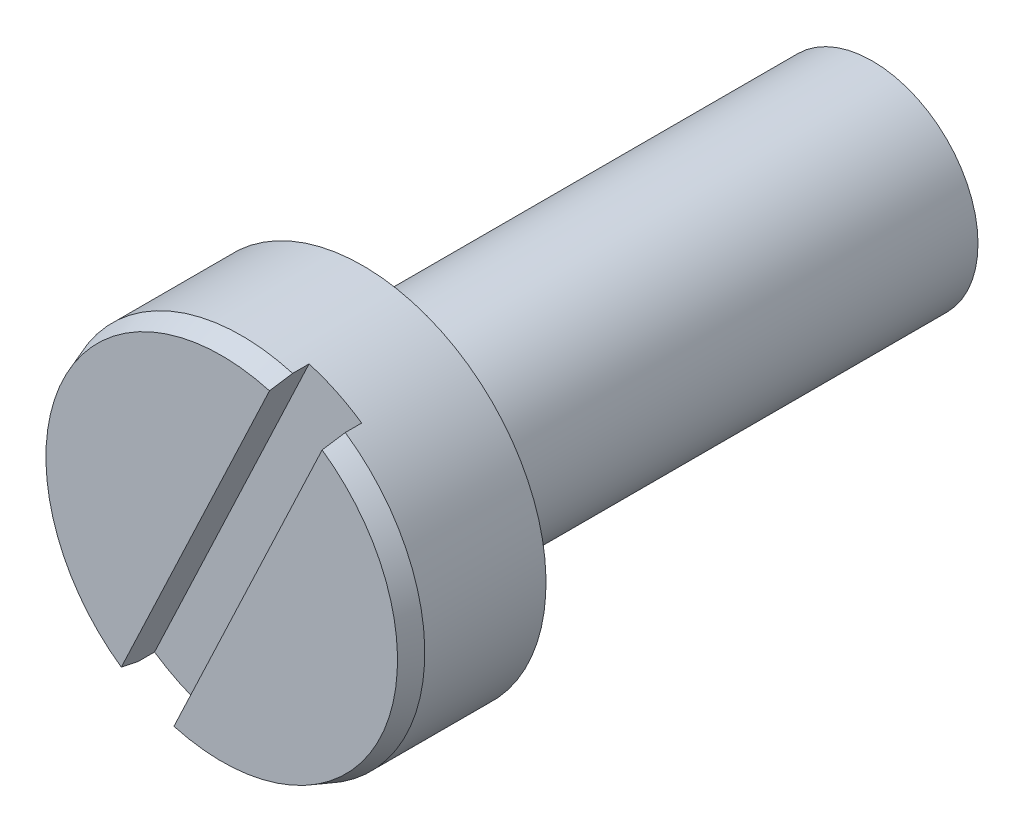
ISO-10303-21;
HEADER;
FILE_DESCRIPTION(('STEP AP214'),'2;1');
FILE_NAME('part.step','',(''),(''),'','','');
FILE_SCHEMA(('AUTOMOTIVE_DESIGN { 1 0 10303 214 1 1 1 1 }'));
ENDSEC;
DATA;
#1=APPLICATION_CONTEXT('core data for automotive mechanical design processes');
#2=APPLICATION_PROTOCOL_DEFINITION('international standard','automotive_design',2000,#1);
#3=PRODUCT_CONTEXT('',#1,'mechanical');
#4=PRODUCT('Part','Part','',(#3));
#5=PRODUCT_RELATED_PRODUCT_CATEGORY('part','',(#4));
#6=PRODUCT_DEFINITION_FORMATION('','',#4);
#7=PRODUCT_DEFINITION_CONTEXT('part definition',#1,'design');
#8=PRODUCT_DEFINITION('design','',#6,#7);
#9=PRODUCT_DEFINITION_SHAPE('','',#8);
#10=(LENGTH_UNIT() NAMED_UNIT(*) SI_UNIT(.MILLI.,.METRE.));
#11=(NAMED_UNIT(*) PLANE_ANGLE_UNIT() SI_UNIT($,.RADIAN.));
#12=(NAMED_UNIT(*) SI_UNIT($,.STERADIAN.) SOLID_ANGLE_UNIT());
#13=UNCERTAINTY_MEASURE_WITH_UNIT(LENGTH_MEASURE(1.E-05),#10,'distance_accuracy_value','');
#14=(GEOMETRIC_REPRESENTATION_CONTEXT(3) GLOBAL_UNCERTAINTY_ASSIGNED_CONTEXT((#13)) GLOBAL_UNIT_ASSIGNED_CONTEXT((#10,
#11,#12)) REPRESENTATION_CONTEXT('',''));
#15=CARTESIAN_POINT('',(0.,0.,0.));
#16=DIRECTION('',(0.,0.,1.));
#17=DIRECTION('',(1.,0.,0.));
#18=AXIS2_PLACEMENT_3D('',#15,#16,#17);
#19=CARTESIAN_POINT('',(22.8721980967912,-23.3190432182495,19.8000000000006));
#20=DIRECTION('',(0.,0.,-1.));
#21=DIRECTION('',(0.427457329703379,0.904035525453982,0.));
#22=AXIS2_PLACEMENT_3D('',#19,#20,#21);
#23=TOROIDAL_SURFACE('',#22,1.95,0.5);
#24=CARTESIAN_POINT('',(22.8721980967912,-23.3190432182495,19.8000000000006));
#25=DIRECTION('',(0.,0.,-1.));
#26=DIRECTION('',(0.427457329703379,0.904035525453982,0.));
#27=AXIS2_PLACEMENT_3D('',#24,#25,#26);
#28=CIRCLE('',#27,1.45);
#29=CARTESIAN_POINT('',(23.4920112248611,-22.0081917063412,19.8000000000006));
#30=VERTEX_POINT('',#29);
#31=EDGE_CURVE('E11',#30,#30,#28,.T.);
#32=ORIENTED_EDGE('',*,*,#31,.F.);
#33=EDGE_LOOP('',(#32));
#34=FACE_BOUND('',#33,.T.);
#35=CARTESIAN_POINT('',(22.8721980967912,-23.3190432182488,20.3000000000006));
#36=DIRECTION('',(0.,0.,1.));
#37=DIRECTION('',(0.427457329703379,0.904035525453982,0.));
#38=AXIS2_PLACEMENT_3D('',#35,#36,#37);
#39=CIRCLE('',#38,1.95);
#40=CARTESIAN_POINT('',(23.7057398897128,-21.5561739436135,20.3000000000006));
#41=VERTEX_POINT('',#40);
#42=EDGE_CURVE('E125',#41,#41,#39,.T.);
#43=ORIENTED_EDGE('',*,*,#42,.F.);
#44=EDGE_LOOP('',(#43));
#45=FACE_BOUND('',#44,.T.);
#46=ADVANCED_FACE('F17',(#34,#45),#23,.F.);
#47=CARTESIAN_POINT('',(22.8721980967912,-23.3190432182486,13.3000000000006));
#48=DIRECTION('',(0.,0.,1.));
#49=DIRECTION('',(-0.427457329703379,-0.904035525453982,0.));
#50=AXIS2_PLACEMENT_3D('',#47,#48,#49);
#51=CONICAL_SURFACE('',#50,1.175252258055,1.221730476396);
#52=CARTESIAN_POINT('',(22.8721980967912,-23.3190432182486,13.3000000000006));
#53=DIRECTION('',(0.,0.,-1.));
#54=DIRECTION('',(0.427457329703379,0.904035525453982,0.));
#55=AXIS2_PLACEMENT_3D('',#52,#53,#54);
#56=CIRCLE('',#55,1.175252258055);
#57=CARTESIAN_POINT('',(23.3745682887473,-22.2565734255969,13.3000000000006));
#58=VERTEX_POINT('',#57);
#59=EDGE_CURVE('E110',#58,#58,#56,.T.);
#60=ORIENTED_EDGE('',*,*,#59,.F.);
#61=EDGE_LOOP('',(#60));
#62=FACE_BOUND('',#61,.T.);
#63=CARTESIAN_POINT('',(22.8721980967912,-23.3190432182495,13.4000000000006));
#64=DIRECTION('',(0.,0.,1.));
#65=DIRECTION('',(0.427457329703379,0.904035525453982,0.));
#66=AXIS2_PLACEMENT_3D('',#63,#64,#65);
#67=CIRCLE('',#66,1.45);
#68=CARTESIAN_POINT('',(23.4920112248611,-22.0081917063412,13.4000000000006));
#69=VERTEX_POINT('',#68);
#70=EDGE_CURVE('E26',#69,#69,#67,.T.);
#71=ORIENTED_EDGE('',*,*,#70,.F.);
#72=EDGE_LOOP('',(#71));
#73=FACE_BOUND('',#72,.T.);
#74=ADVANCED_FACE('F181',(#62,#73),#51,.T.);
#75=CARTESIAN_POINT('',(22.8721980967912,-23.3190432182488,20.3000000000006));
#76=DIRECTION('',(0.,0.,1.));
#77=DIRECTION('',(-0.427457329703379,-0.904035525453982,0.));
#78=AXIS2_PLACEMENT_3D('',#75,#76,#77);
#79=CONICAL_SURFACE('',#78,2.240252258055,1.221730476396);
#80=CARTESIAN_POINT('',(22.8721980967912,-23.3190432182488,20.3000000000006));
#81=DIRECTION('',(0.,0.,-1.));
#82=DIRECTION('',(0.427457329703379,0.904035525453982,0.));
#83=AXIS2_PLACEMENT_3D('',#80,#81,#82);
#84=CIRCLE('',#83,2.240252258055);
#85=CARTESIAN_POINT('',(23.8298103448814,-21.2937755909886,20.3000000000006));
#86=VERTEX_POINT('',#85);
#87=EDGE_CURVE('E121',#86,#86,#84,.T.);
#88=ORIENTED_EDGE('',*,*,#87,.F.);
#89=EDGE_LOOP('',(#88));
#90=FACE_BOUND('',#89,.T.);
#91=CARTESIAN_POINT('',(22.8721980967912,-23.3190432182486,20.4000000000006));
#92=DIRECTION('',(0.,0.,1.));
#93=DIRECTION('',(0.427457329703379,0.904035525453982,0.));
#94=AXIS2_PLACEMENT_3D('',#91,#92,#93);
#95=CIRCLE('',#94,2.515);
#96=CARTESIAN_POINT('',(23.9472532809952,-21.0453938717319,20.4000000000006));
#97=VERTEX_POINT('',#96);
#98=EDGE_CURVE('E68',#97,#97,#95,.T.);
#99=ORIENTED_EDGE('',*,*,#98,.F.);
#100=EDGE_LOOP('',(#99));
#101=FACE_BOUND('',#100,.T.);
#102=ADVANCED_FACE('F186',(#90,#101),#79,.T.);
#103=CARTESIAN_POINT('',(22.8721980967912,-23.3190432182486,13.3000000000006));
#104=DIRECTION('',(0.,0.,-1.));
#105=DIRECTION('',(0.427457329703379,0.904035525453982,0.));
#106=AXIS2_PLACEMENT_3D('',#103,#104,#105);
#107=CYLINDRICAL_SURFACE('',#106,1.45);
#108=ORIENTED_EDGE('',*,*,#31,.T.);
#109=EDGE_LOOP('',(#108));
#110=FACE_BOUND('',#109,.T.);
#111=ORIENTED_EDGE('',*,*,#70,.T.);
#112=EDGE_LOOP('',(#111));
#113=FACE_BOUND('',#112,.T.);
#114=ADVANCED_FACE('F174',(#110,#113),#107,.T.);
#115=CARTESIAN_POINT('',(22.8721980967912,-23.3190432182486,13.3000000000006));
#116=DIRECTION('',(0.,0.,-1.));
#117=DIRECTION('',(0.427457329703379,0.904035525453982,0.));
#118=AXIS2_PLACEMENT_3D('',#115,#116,#117);
#119=CYLINDRICAL_SURFACE('',#118,2.515);
#120=CARTESIAN_POINT('',(22.8721980967912,-23.3190432182492,21.8400000000006));
#121=DIRECTION('',(0.,0.,-1.));
#122=DIRECTION('',(-0.427457329703369,-0.904035525453986,0.));
#123=AXIS2_PLACEMENT_3D('',#120,#121,#122);
#124=CIRCLE('',#123,2.515);
#125=CARTESIAN_POINT('',(22.1724412662472,-25.7347347089221,21.8400000000007));
#126=VERTEX_POINT('',#125);
#127=CARTESIAN_POINT('',(21.4492128458852,-25.3927688451593,21.8400000000006));
#128=VERTEX_POINT('',#127);
#129=EDGE_CURVE('E145',#126,#128,#124,.T.);
#130=ORIENTED_EDGE('',*,*,#129,.T.);
#131=DIRECTION('',(0.,0.,-1.));
#132=VECTOR('',#131,1.);
#133=CARTESIAN_POINT('',(21.4492128458852,-25.3927688451593,13.3000000000006));
#134=LINE('',#133,#132);
#135=CARTESIAN_POINT('',(21.4492128458852,-25.3927688451593,22.0652522580557));
#136=VERTEX_POINT('',#135);
#137=EDGE_CURVE('E64',#136,#128,#134,.T.);
#138=ORIENTED_EDGE('',*,*,#137,.F.);
#139=CARTESIAN_POINT('',(22.8721980967912,-23.3190432182491,22.0652522580556));
#140=DIRECTION('',(0.,0.,-1.));
#141=DIRECTION('',(-0.427457329703379,-0.904035525453982,0.));
#142=AXIS2_PLACEMENT_3D('',#139,#140,#141);
#143=CIRCLE('',#142,2.515);
#144=CARTESIAN_POINT('',(23.5719549273342,-20.9033517275762,22.0652522580557));
#145=VERTEX_POINT('',#144);
#146=EDGE_CURVE('E53',#136,#145,#143,.T.);
#147=ORIENTED_EDGE('',*,*,#146,.T.);
#148=DIRECTION('',(0.,0.,1.));
#149=VECTOR('',#148,1.);
#150=CARTESIAN_POINT('',(23.5719549273352,-20.9033517275767,13.3000000000006));
#151=LINE('',#150,#149);
#152=CARTESIAN_POINT('',(23.5719549273342,-20.9033517275763,21.8400000000006));
#153=VERTEX_POINT('',#152);
#154=EDGE_CURVE('E61',#153,#145,#151,.T.);
#155=ORIENTED_EDGE('',*,*,#154,.F.);
#156=CARTESIAN_POINT('',(22.8721980967912,-23.3190432182492,21.8400000000006));
#157=DIRECTION('',(0.,0.,-1.));
#158=DIRECTION('',(-0.427457329703379,-0.904035525453982,0.));
#159=AXIS2_PLACEMENT_3D('',#156,#157,#158);
#160=CIRCLE('',#159,2.515);
#161=CARTESIAN_POINT('',(24.2951833476972,-21.2453175913393,21.8400000000006));
#162=VERTEX_POINT('',#161);
#163=EDGE_CURVE('E93',#153,#162,#160,.T.);
#164=ORIENTED_EDGE('',*,*,#163,.T.);
#165=DIRECTION('',(0.,0.,-1.));
#166=VECTOR('',#165,1.);
#167=CARTESIAN_POINT('',(24.2951833476972,-21.2453175913386,13.3000000000006));
#168=LINE('',#167,#166);
#169=CARTESIAN_POINT('',(24.2951833476972,-21.2453175913392,22.0652522580557));
#170=VERTEX_POINT('',#169);
#171=EDGE_CURVE('E96',#170,#162,#168,.T.);
#172=ORIENTED_EDGE('',*,*,#171,.F.);
#173=CARTESIAN_POINT('',(22.1724412662472,-25.7347347089221,22.0652522580557));
#174=VERTEX_POINT('',#173);
#175=EDGE_CURVE('E106',#170,#174,#143,.T.);
#176=ORIENTED_EDGE('',*,*,#175,.T.);
#177=DIRECTION('',(0.,0.,1.));
#178=VECTOR('',#177,1.);
#179=CARTESIAN_POINT('',(22.1724412662472,-25.7347347089221,13.3000000000006));
#180=LINE('',#179,#178);
#181=EDGE_CURVE('E103',#126,#174,#180,.T.);
#182=ORIENTED_EDGE('',*,*,#181,.F.);
#183=EDGE_LOOP('',(#130,#138,#147,#155,#164,#172,#176,#182));
#184=FACE_BOUND('',#183,.T.);
#185=ORIENTED_EDGE('',*,*,#98,.T.);
#186=EDGE_LOOP('',(#185));
#187=FACE_BOUND('',#186,.T.);
#188=ADVANCED_FACE('F56',(#184,#187),#119,.T.);
#189=CARTESIAN_POINT('',(22.8721980967912,-23.3190432182496,22.3400000000006));
#190=DIRECTION('',(0.,0.,1.));
#191=DIRECTION('',(-0.427457329703379,-0.904035525453982,0.));
#192=AXIS2_PLACEMENT_3D('',#189,#190,#191);
#193=PLANE('',#192);
#194=DIRECTION('',(-0.427457329703379,-0.904035525453982,0.));
#195=VECTOR('',#194,1.);
#196=CARTESIAN_POINT('',(21.2127342221062,-25.8929008163535,22.3400000000006));
#197=LINE('',#196,#195);
#198=CARTESIAN_POINT('',(23.5286347891242,-20.9949700978505,22.3400000000007));
#199=VERTEX_POINT('',#198);
#200=CARTESIAN_POINT('',(21.4925329840942,-25.3011504748848,22.3400000000006));
#201=VERTEX_POINT('',#200);
#202=EDGE_CURVE('E76',#199,#201,#197,.T.);
#203=ORIENTED_EDGE('',*,*,#202,.F.);
#204=CARTESIAN_POINT('',(22.8721980967912,-23.3190432182496,22.3400000000006));
#205=DIRECTION('',(0.,0.,1.));
#206=DIRECTION('',(-0.427457329703379,-0.904035525453982,0.));
#207=AXIS2_PLACEMENT_3D('',#204,#205,#206);
#208=CIRCLE('',#207,2.415);
#209=EDGE_CURVE('E36',#199,#201,#208,.T.);
#210=ORIENTED_EDGE('',*,*,#209,.T.);
#211=EDGE_LOOP('',(#203,#210));
#212=FACE_BOUND('',#211,.T.);
#213=ADVANCED_FACE('F163',(#212),#193,.T.);
#214=CARTESIAN_POINT('',(22.8721980967912,-23.3190432182491,22.0652522580556));
#215=DIRECTION('',(0.,0.,-1.));
#216=DIRECTION('',(0.427457329703379,0.904035525453982,0.));
#217=AXIS2_PLACEMENT_3D('',#214,#215,#216);
#218=CONICAL_SURFACE('',#217,2.515,0.349065850399);
#219=CARTESIAN_POINT('',(350.117732713186,669.712911670742,-261.393080578831));
#220=DIRECTION('',(0.904035525452299,-0.427457329706938,1.46077674032882E-12));
#221=DIRECTION('',(-0.401017918661995,-0.848118442749434,0.346236531839547));
#222=AXIS2_PLACEMENT_3D('',#219,#220,#221);
#223=CIRCLE('',#222,819.477595478914);
#224=EDGE_CURVE('E153',#201,#136,#223,.T.);
#225=ORIENTED_EDGE('',*,*,#224,.F.);
#226=ORIENTED_EDGE('',*,*,#209,.F.);
#227=CARTESIAN_POINT('',(-305.096562303543,-716.009026675723,-261.393078306499));
#228=DIRECTION('',(0.904035525453982,-0.427457329703379,0.));
#229=DIRECTION('',(0.401070781773213,0.848230243697522,0.345901260021795));
#230=AXIS2_PLACEMENT_3D('',#227,#228,#229);
#231=CIRCLE('',#230,819.477588912782);
#232=EDGE_CURVE('E71',#145,#199,#231,.T.);
#233=ORIENTED_EDGE('',*,*,#232,.F.);
#234=ORIENTED_EDGE('',*,*,#146,.F.);
#235=EDGE_LOOP('',(#225,#226,#233,#234));
#236=FACE_BOUND('',#235,.T.);
#237=ADVANCED_FACE('F72',(#236),#218,.T.);
#238=DIRECTION('',(0.427457329703379,0.904035525453982,0.));
#239=VECTOR('',#238,1.);
#240=CARTESIAN_POINT('',(21.9359626424691,-26.2348666801163,22.3400000000006));
#241=LINE('',#240,#239);
#242=CARTESIAN_POINT('',(22.2157614044582,-25.6431163386476,22.3400000000006));
#243=VERTEX_POINT('',#242);
#244=CARTESIAN_POINT('',(24.2518632094882,-21.3369359616136,22.3400000000007));
#245=VERTEX_POINT('',#244);
#246=EDGE_CURVE('E246',#243,#245,#241,.T.);
#247=ORIENTED_EDGE('',*,*,#246,.F.);
#248=EDGE_CURVE('E111',#243,#245,#208,.T.);
#249=ORIENTED_EDGE('',*,*,#248,.T.);
#250=EDGE_LOOP('',(#247,#249));
#251=FACE_BOUND('',#250,.T.);
#252=ADVANCED_FACE('F166',(#251),#193,.T.);
#253=CARTESIAN_POINT('',(25.1458474433082,-24.3940984024528,20.3000000000007));
#254=DIRECTION('',(0.,0.,-1.));
#255=DIRECTION('',(0.427457329703379,0.904035525453982,0.));
#256=AXIS2_PLACEMENT_3D('',#253,#254,#255);
#257=PLANE('',#256);
#258=ORIENTED_EDGE('',*,*,#42,.T.);
#259=EDGE_LOOP('',(#258));
#260=FACE_BOUND('',#259,.T.);
#261=ORIENTED_EDGE('',*,*,#87,.T.);
#262=EDGE_LOOP('',(#261));
#263=FACE_BOUND('',#262,.T.);
#264=ADVANCED_FACE('F178',(#260,#263),#257,.T.);
#265=CARTESIAN_POINT('',(24.1830496087002,-23.9388563463186,13.3000000000006));
#266=DIRECTION('',(0.,0.,-1.));
#267=DIRECTION('',(0.427457329703379,0.904035525453982,0.));
#268=AXIS2_PLACEMENT_3D('',#265,#266,#267);
#269=PLANE('',#268);
#270=ORIENTED_EDGE('',*,*,#59,.T.);
#271=EDGE_LOOP('',(#270));
#272=FACE_BOUND('',#271,.T.);
#273=ADVANCED_FACE('F208',(#272),#269,.T.);
#274=CARTESIAN_POINT('',(-304.373336519596,-716.350998107235,-261.393080578849));
#275=DIRECTION('',(-0.904035525452299,0.427457329706938,1.44341947337369E-12));
#276=DIRECTION('',(0.401017918661986,0.848118442749428,0.346236531839572));
#277=AXIS2_PLACEMENT_3D('',#274,#275,#276);
#278=CIRCLE('',#277,819.477595478914);
#279=EDGE_CURVE('E86',#245,#170,#278,.T.);
#280=ORIENTED_EDGE('',*,*,#279,.F.);
#281=ORIENTED_EDGE('',*,*,#248,.F.);
#282=CARTESIAN_POINT('',(350.840958497132,669.37094023923,-261.39307830648));
#283=DIRECTION('',(-0.904035525453982,0.427457329703379,0.));
#284=DIRECTION('',(-0.401070781773222,-0.848230243697527,0.345901260021773));
#285=AXIS2_PLACEMENT_3D('',#282,#283,#284);
#286=CIRCLE('',#285,819.477588912782);
#287=EDGE_CURVE('E115',#174,#243,#286,.T.);
#288=ORIENTED_EDGE('',*,*,#287,.F.);
#289=ORIENTED_EDGE('',*,*,#175,.F.);
#290=EDGE_LOOP('',(#280,#281,#288,#289));
#291=FACE_BOUND('',#290,.T.);
#292=ADVANCED_FACE('F173',(#291),#218,.T.);
#293=CARTESIAN_POINT('',(21.2127342221062,-25.8929008163535,21.8400000000006));
#294=DIRECTION('',(-0.904035525453982,0.427457329703379,0.));
#295=DIRECTION('',(-0.427457329703379,-0.904035525453982,0.));
#296=AXIS2_PLACEMENT_3D('',#293,#294,#295);
#297=PLANE('',#296);
#298=ORIENTED_EDGE('',*,*,#137,.T.);
#299=DIRECTION('',(-0.427457329703379,-0.904035525453982,0.));
#300=VECTOR('',#299,1.);
#301=CARTESIAN_POINT('',(21.2127342221062,-25.8929008163535,21.8400000000006));
#302=LINE('',#301,#300);
#303=EDGE_CURVE('E81',#153,#128,#302,.T.);
#304=ORIENTED_EDGE('',*,*,#303,.F.);
#305=ORIENTED_EDGE('',*,*,#154,.T.);
#306=ORIENTED_EDGE('',*,*,#232,.T.);
#307=ORIENTED_EDGE('',*,*,#202,.T.);
#308=ORIENTED_EDGE('',*,*,#224,.T.);
#309=EDGE_LOOP('',(#298,#304,#305,#306,#307,#308));
#310=FACE_BOUND('',#309,.T.);
#311=ADVANCED_FACE('F79',(#310),#297,.F.);
#312=CARTESIAN_POINT('',(21.9359626424691,-26.2348666801163,21.8400000000006));
#313=DIRECTION('',(0.904035525453982,-0.427457329703379,0.));
#314=DIRECTION('',(0.427457329703379,0.904035525453982,0.));
#315=AXIS2_PLACEMENT_3D('',#312,#313,#314);
#316=PLANE('',#315);
#317=ORIENTED_EDGE('',*,*,#171,.T.);
#318=DIRECTION('',(0.427457329703379,0.904035525453982,0.));
#319=VECTOR('',#318,1.);
#320=CARTESIAN_POINT('',(21.9359626424691,-26.2348666801163,21.8400000000006));
#321=LINE('',#320,#319);
#322=EDGE_CURVE('E97',#126,#162,#321,.T.);
#323=ORIENTED_EDGE('',*,*,#322,.F.);
#324=ORIENTED_EDGE('',*,*,#181,.T.);
#325=ORIENTED_EDGE('',*,*,#287,.T.);
#326=ORIENTED_EDGE('',*,*,#246,.T.);
#327=ORIENTED_EDGE('',*,*,#279,.T.);
#328=EDGE_LOOP('',(#317,#323,#324,#325,#326,#327));
#329=FACE_BOUND('',#328,.T.);
#330=ADVANCED_FACE('F217',(#329),#316,.F.);
#331=CARTESIAN_POINT('',(22.8721980967912,-23.3190432182492,21.8400000000006));
#332=DIRECTION('',(0.,0.,1.));
#333=DIRECTION('',(-0.427457329703379,-0.904035525453982,0.));
#334=AXIS2_PLACEMENT_3D('',#331,#332,#333);
#335=PLANE('',#334);
#336=ORIENTED_EDGE('',*,*,#303,.T.);
#337=ORIENTED_EDGE('',*,*,#129,.F.);
#338=ORIENTED_EDGE('',*,*,#322,.T.);
#339=ORIENTED_EDGE('',*,*,#163,.F.);
#340=EDGE_LOOP('',(#336,#337,#338,#339));
#341=FACE_BOUND('',#340,.T.);
#342=ADVANCED_FACE('F220',(#341),#335,.T.);
#343=CLOSED_SHELL('',(#46,#74,#102,#114,#188,#213,#237,#252,#264,#273,#292,#311,#330,#342));
#344=MANIFOLD_SOLID_BREP('B1',#343);
#345=ADVANCED_BREP_SHAPE_REPRESENTATION('',(#18,#344),#14);
#346=SHAPE_DEFINITION_REPRESENTATION(#9,#345);
ENDSEC;
END-ISO-10303-21;
